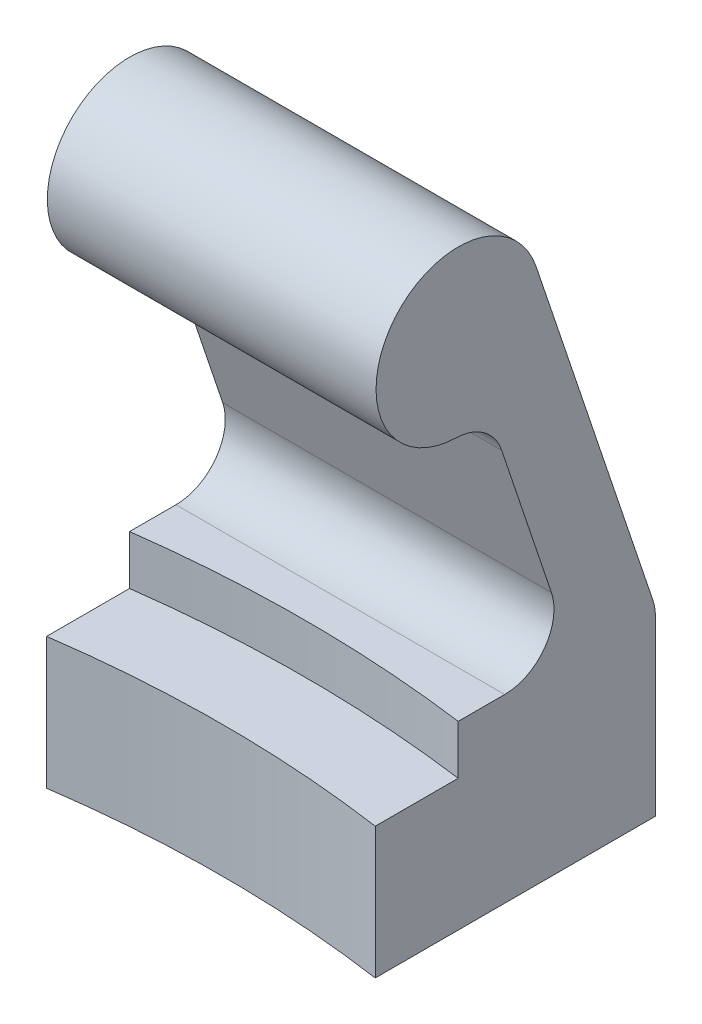
ISO-10303-21;
HEADER;
FILE_DESCRIPTION(('STEP AP214'),'2;1');
FILE_NAME('part.step','',(''),(''),'','','');
FILE_SCHEMA(('AUTOMOTIVE_DESIGN { 1 0 10303 214 1 1 1 1 }'));
ENDSEC;
DATA;
#1=APPLICATION_CONTEXT('core data for automotive mechanical design processes');
#2=APPLICATION_PROTOCOL_DEFINITION('international standard','automotive_design',2000,#1);
#3=PRODUCT_CONTEXT('',#1,'mechanical');
#4=PRODUCT('Part','Part','',(#3));
#5=PRODUCT_RELATED_PRODUCT_CATEGORY('part','',(#4));
#6=PRODUCT_DEFINITION_FORMATION('','',#4);
#7=PRODUCT_DEFINITION_CONTEXT('part definition',#1,'design');
#8=PRODUCT_DEFINITION('design','',#6,#7);
#9=PRODUCT_DEFINITION_SHAPE('','',#8);
#10=(LENGTH_UNIT() NAMED_UNIT(*) SI_UNIT(.MILLI.,.METRE.));
#11=(NAMED_UNIT(*) PLANE_ANGLE_UNIT() SI_UNIT($,.RADIAN.));
#12=(NAMED_UNIT(*) SI_UNIT($,.STERADIAN.) SOLID_ANGLE_UNIT());
#13=UNCERTAINTY_MEASURE_WITH_UNIT(LENGTH_MEASURE(1.E-05),#10,'distance_accuracy_value','');
#14=(GEOMETRIC_REPRESENTATION_CONTEXT(3) GLOBAL_UNCERTAINTY_ASSIGNED_CONTEXT((#13)) GLOBAL_UNIT_ASSIGNED_CONTEXT((#10,
#11,#12)) REPRESENTATION_CONTEXT('',''));
#15=CARTESIAN_POINT('',(0.,0.,0.));
#16=DIRECTION('',(0.,0.,1.));
#17=DIRECTION('',(1.,0.,0.));
#18=AXIS2_PLACEMENT_3D('',#15,#16,#17);
#19=CARTESIAN_POINT('',(0.,11.,0.));
#20=DIRECTION('',(0.,-1.,0.));
#21=DIRECTION('',(0.,0.,-1.));
#22=AXIS2_PLACEMENT_3D('',#19,#20,#21);
#23=PLANE('',#22);
#24=DIRECTION('',(0.,0.,-1.));
#25=VECTOR('',#24,1.);
#26=CARTESIAN_POINT('',(10.,11.,-86.3303437365925));
#27=LINE('',#26,#25);
#28=CARTESIAN_POINT('',(10.,11.,-74.3303437365925));
#29=VERTEX_POINT('',#28);
#30=CARTESIAN_POINT('',(10.,11.,-77.1565551566178));
#31=VERTEX_POINT('',#30);
#32=EDGE_CURVE('E169',#29,#31,#27,.T.);
#33=ORIENTED_EDGE('',*,*,#32,.T.);
#34=DIRECTION('',(1.,0.,0.));
#35=VECTOR('',#34,1.);
#36=CARTESIAN_POINT('',(0.,11.,-77.1565551566178));
#37=LINE('',#36,#35);
#38=CARTESIAN_POINT('',(-10.,11.,-77.1565551566178));
#39=VERTEX_POINT('',#38);
#40=EDGE_CURVE('E244',#31,#39,#37,.F.);
#41=ORIENTED_EDGE('',*,*,#40,.T.);
#42=DIRECTION('',(0.,0.,1.));
#43=VECTOR('',#42,1.);
#44=CARTESIAN_POINT('',(-10.,11.,-74.3303437365925));
#45=LINE('',#44,#43);
#46=CARTESIAN_POINT('',(-10.,11.,-74.3303437365925));
#47=VERTEX_POINT('',#46);
#48=EDGE_CURVE('E172',#39,#47,#45,.T.);
#49=ORIENTED_EDGE('',*,*,#48,.T.);
#50=CARTESIAN_POINT('',(0.,11.,0.));
#51=DIRECTION('',(0.,-1.,0.));
#52=DIRECTION('',(0.,0.,-1.));
#53=AXIS2_PLACEMENT_3D('',#50,#51,#52);
#54=CIRCLE('',#53,75.);
#55=EDGE_CURVE('E165',#47,#29,#54,.T.);
#56=ORIENTED_EDGE('',*,*,#55,.T.);
#57=EDGE_LOOP('',(#33,#41,#49,#56));
#58=FACE_BOUND('',#57,.T.);
#59=ADVANCED_FACE('F39',(#58),#23,.F.);
#60=CARTESIAN_POINT('',(0.,8.,0.));
#61=DIRECTION('',(0.,-1.,0.));
#62=DIRECTION('',(0.,0.,-1.));
#63=AXIS2_PLACEMENT_3D('',#60,#61,#62);
#64=PLANE('',#63);
#65=CARTESIAN_POINT('',(0.,8.,0.));
#66=DIRECTION('',(0.,-1.,0.));
#67=DIRECTION('',(0.,0.,-1.));
#68=AXIS2_PLACEMENT_3D('',#65,#66,#67);
#69=CIRCLE('',#68,75.);
#70=CARTESIAN_POINT('',(-10.,8.,-74.3303437365925));
#71=VERTEX_POINT('',#70);
#72=CARTESIAN_POINT('',(10.,8.,-74.3303437365925));
#73=VERTEX_POINT('',#72);
#74=EDGE_CURVE('E164',#71,#73,#69,.T.);
#75=ORIENTED_EDGE('',*,*,#74,.F.);
#76=DIRECTION('',(0.,0.,1.));
#77=VECTOR('',#76,1.);
#78=CARTESIAN_POINT('',(-10.,8.,-74.3303437365925));
#79=LINE('',#78,#77);
#80=CARTESIAN_POINT('',(-10.,8.,-69.2820323027551));
#81=VERTEX_POINT('',#80);
#82=EDGE_CURVE('E195',#71,#81,#79,.T.);
#83=ORIENTED_EDGE('',*,*,#82,.T.);
#84=CARTESIAN_POINT('',(0.,8.,0.));
#85=DIRECTION('',(0.,-1.,0.));
#86=DIRECTION('',(0.,0.,-1.));
#87=AXIS2_PLACEMENT_3D('',#84,#85,#86);
#88=CIRCLE('',#87,70.);
#89=CARTESIAN_POINT('',(10.,8.,-69.2820323027551));
#90=VERTEX_POINT('',#89);
#91=EDGE_CURVE('E187',#81,#90,#88,.T.);
#92=ORIENTED_EDGE('',*,*,#91,.T.);
#93=DIRECTION('',(0.,0.,-1.));
#94=VECTOR('',#93,1.);
#95=CARTESIAN_POINT('',(10.,8.,-69.2820323027551));
#96=LINE('',#95,#94);
#97=EDGE_CURVE('E191',#90,#73,#96,.T.);
#98=ORIENTED_EDGE('',*,*,#97,.T.);
#99=EDGE_LOOP('',(#75,#83,#92,#98));
#100=FACE_BOUND('',#99,.T.);
#101=ADVANCED_FACE('F280',(#100),#64,.F.);
#102=CARTESIAN_POINT('',(0.,8.,0.));
#103=DIRECTION('',(0.,-1.,0.));
#104=DIRECTION('',(0.,0.,-1.));
#105=AXIS2_PLACEMENT_3D('',#102,#103,#104);
#106=CYLINDRICAL_SURFACE('',#105,70.);
#107=CARTESIAN_POINT('',(0.,0.,0.));
#108=DIRECTION('',(0.,-1.,0.));
#109=DIRECTION('',(0.,0.,-1.));
#110=AXIS2_PLACEMENT_3D('',#107,#108,#109);
#111=CIRCLE('',#110,70.);
#112=CARTESIAN_POINT('',(-10.,0.,-69.2820323027551));
#113=VERTEX_POINT('',#112);
#114=CARTESIAN_POINT('',(10.,0.,-69.2820323027551));
#115=VERTEX_POINT('',#114);
#116=EDGE_CURVE('E186',#113,#115,#111,.T.);
#117=ORIENTED_EDGE('',*,*,#116,.T.);
#118=DIRECTION('',(0.,-1.,0.));
#119=VECTOR('',#118,1.);
#120=CARTESIAN_POINT('',(10.,8.,-69.2820323027551));
#121=LINE('',#120,#119);
#122=EDGE_CURVE('E221',#90,#115,#121,.T.);
#123=ORIENTED_EDGE('',*,*,#122,.F.);
#124=ORIENTED_EDGE('',*,*,#91,.F.);
#125=DIRECTION('',(0.,-1.,0.));
#126=VECTOR('',#125,1.);
#127=CARTESIAN_POINT('',(-10.,8.,-69.2820323027551));
#128=LINE('',#127,#126);
#129=EDGE_CURVE('E198',#81,#113,#128,.T.);
#130=ORIENTED_EDGE('',*,*,#129,.T.);
#131=EDGE_LOOP('',(#117,#123,#124,#130));
#132=FACE_BOUND('',#131,.T.);
#133=ADVANCED_FACE('F282',(#132),#106,.F.);
#134=CARTESIAN_POINT('',(10.,8.,-86.3303437365925));
#135=DIRECTION('',(-1.,0.,0.));
#136=DIRECTION('',(0.,0.,1.));
#137=AXIS2_PLACEMENT_3D('',#134,#135,#136);
#138=PLANE('',#137);
#139=DIRECTION('',(0.,-1.,0.));
#140=VECTOR('',#139,1.);
#141=CARTESIAN_POINT('',(10.,8.,-86.3303437365925));
#142=LINE('',#141,#140);
#143=CARTESIAN_POINT('',(10.,10.5091344412137,-86.3303437365925));
#144=VERTEX_POINT('',#143);
#145=CARTESIAN_POINT('',(10.,0.,-86.3303437365925));
#146=VERTEX_POINT('',#145);
#147=EDGE_CURVE('E218',#144,#146,#142,.T.);
#148=ORIENTED_EDGE('',*,*,#147,.F.);
#149=CARTESIAN_POINT('',(10.,10.5091344412137,-83.3303437365925));
#150=DIRECTION('',(-1.,0.,0.));
#151=DIRECTION('',(0.,0.,1.));
#152=AXIS2_PLACEMENT_3D('',#149,#150,#151);
#153=CIRCLE('',#152,3.);
#154=CARTESIAN_POINT('',(10.,11.465267849288,-86.1738994167163));
#155=VERTEX_POINT('',#154);
#156=EDGE_CURVE('E133',#144,#155,#153,.F.);
#157=ORIENTED_EDGE('',*,*,#156,.T.);
#158=DIRECTION('',(0.,0.947851893374597,0.318711136024758));
#159=VECTOR('',#158,1.);
#160=CARTESIAN_POINT('',(10.,11.,-86.3303437365925));
#161=LINE('',#160,#159);
#162=CARTESIAN_POINT('',(10.,32.5935556801238,-79.0696032034655));
#163=VERTEX_POINT('',#162);
#164=EDGE_CURVE('E126',#155,#163,#161,.T.);
#165=ORIENTED_EDGE('',*,*,#164,.T.);
#166=CARTESIAN_POINT('',(10.,31.,-74.3303437365925));
#167=DIRECTION('',(1.,0.,0.));
#168=DIRECTION('',(0.,0.,1.));
#169=AXIS2_PLACEMENT_3D('',#166,#167,#168);
#170=CIRCLE('',#169,5.);
#171=CARTESIAN_POINT('',(10.,26.0015760247574,-74.2048138050237));
#172=VERTEX_POINT('',#171);
#173=EDGE_CURVE('E131',#163,#172,#170,.T.);
#174=ORIENTED_EDGE('',*,*,#173,.T.);
#175=CARTESIAN_POINT('',(10.,23.0025216396118,-74.1294958460825));
#176=DIRECTION('',(-1.,0.,0.));
#177=DIRECTION('',(0.,0.,1.));
#178=AXIS2_PLACEMENT_3D('',#175,#176,#177);
#179=CIRCLE('',#178,3.);
#180=CARTESIAN_POINT('',(10.,23.9586550476861,-76.9730515262063));
#181=VERTEX_POINT('',#180);
#182=EDGE_CURVE('E247',#172,#181,#179,.T.);
#183=ORIENTED_EDGE('',*,*,#182,.T.);
#184=DIRECTION('',(0.,-0.947851893374597,-0.318711136024758));
#185=VECTOR('',#184,1.);
#186=CARTESIAN_POINT('',(10.,26.3502898620252,-76.1688745720192));
#187=LINE('',#186,#185);
#188=CARTESIAN_POINT('',(10.,14.9561334080743,-80.0001108367416));
#189=VERTEX_POINT('',#188);
#190=EDGE_CURVE('E149',#181,#189,#187,.T.);
#191=ORIENTED_EDGE('',*,*,#190,.T.);
#192=CARTESIAN_POINT('',(10.,14.,-77.1565551566178));
#193=DIRECTION('',(-1.,0.,0.));
#194=DIRECTION('',(0.,0.,1.));
#195=AXIS2_PLACEMENT_3D('',#192,#193,#194);
#196=CIRCLE('',#195,3.);
#197=EDGE_CURVE('E48',#189,#31,#196,.T.);
#198=ORIENTED_EDGE('',*,*,#197,.T.);
#199=ORIENTED_EDGE('',*,*,#32,.F.);
#200=DIRECTION('',(0.,-1.,0.));
#201=VECTOR('',#200,1.);
#202=CARTESIAN_POINT('',(10.,11.,-74.3303437365925));
#203=LINE('',#202,#201);
#204=EDGE_CURVE('E182',#29,#73,#203,.T.);
#205=ORIENTED_EDGE('',*,*,#204,.T.);
#206=ORIENTED_EDGE('',*,*,#97,.F.);
#207=ORIENTED_EDGE('',*,*,#122,.T.);
#208=DIRECTION('',(0.,0.,-1.));
#209=VECTOR('',#208,1.);
#210=CARTESIAN_POINT('',(10.,0.,-86.3303437365925));
#211=LINE('',#210,#209);
#212=EDGE_CURVE('E202',#115,#146,#211,.T.);
#213=ORIENTED_EDGE('',*,*,#212,.T.);
#214=EDGE_LOOP('',(#148,#157,#165,#174,#183,#191,#198,#199,#205,#206,#207,#213));
#215=FACE_BOUND('',#214,.T.);
#216=ADVANCED_FACE('F129',(#215),#138,.F.);
#217=CARTESIAN_POINT('',(-10.,8.,-86.3303437365925));
#218=DIRECTION('',(0.,0.,1.));
#219=DIRECTION('',(1.,0.,0.));
#220=AXIS2_PLACEMENT_3D('',#217,#218,#219);
#221=PLANE('',#220);
#222=DIRECTION('',(0.,-1.,0.));
#223=VECTOR('',#222,1.);
#224=CARTESIAN_POINT('',(-10.,8.,-86.3303437365925));
#225=LINE('',#224,#223);
#226=CARTESIAN_POINT('',(-10.,10.5091344412137,-86.3303437365925));
#227=VERTEX_POINT('',#226);
#228=CARTESIAN_POINT('',(-10.,0.,-86.3303437365925));
#229=VERTEX_POINT('',#228);
#230=EDGE_CURVE('E215',#227,#229,#225,.T.);
#231=ORIENTED_EDGE('',*,*,#230,.F.);
#232=DIRECTION('',(-1.,0.,0.));
#233=VECTOR('',#232,1.);
#234=CARTESIAN_POINT('',(10.,10.5091344412137,-86.3303437365925));
#235=LINE('',#234,#233);
#236=EDGE_CURVE('E231',#227,#144,#235,.F.);
#237=ORIENTED_EDGE('',*,*,#236,.T.);
#238=ORIENTED_EDGE('',*,*,#147,.T.);
#239=DIRECTION('',(-1.,0.,0.));
#240=VECTOR('',#239,1.);
#241=CARTESIAN_POINT('',(-10.,0.,-86.3303437365925));
#242=LINE('',#241,#240);
#243=EDGE_CURVE('E206',#146,#229,#242,.T.);
#244=ORIENTED_EDGE('',*,*,#243,.T.);
#245=EDGE_LOOP('',(#231,#237,#238,#244));
#246=FACE_BOUND('',#245,.T.);
#247=ADVANCED_FACE('F293',(#246),#221,.F.);
#248=CARTESIAN_POINT('',(-10.,8.,-69.2820323027551));
#249=DIRECTION('',(1.,0.,0.));
#250=DIRECTION('',(0.,0.,-1.));
#251=AXIS2_PLACEMENT_3D('',#248,#249,#250);
#252=PLANE('',#251);
#253=DIRECTION('',(0.,-0.947851893374597,-0.318711136024758));
#254=VECTOR('',#253,1.);
#255=CARTESIAN_POINT('',(-9.99999999999999,11.,-86.3303437365925));
#256=LINE('',#255,#254);
#257=CARTESIAN_POINT('',(-10.,32.5935556801238,-79.0696032034655));
#258=VERTEX_POINT('',#257);
#259=CARTESIAN_POINT('',(-9.99999999999999,11.465267849288,-86.1738994167163));
#260=VERTEX_POINT('',#259);
#261=EDGE_CURVE('E144',#258,#260,#256,.T.);
#262=ORIENTED_EDGE('',*,*,#261,.T.);
#263=CARTESIAN_POINT('',(-10.,10.5091344412137,-83.3303437365925));
#264=DIRECTION('',(1.,0.,0.));
#265=DIRECTION('',(0.,0.,-1.));
#266=AXIS2_PLACEMENT_3D('',#263,#264,#265);
#267=CIRCLE('',#266,3.);
#268=EDGE_CURVE('E228',#260,#227,#267,.F.);
#269=ORIENTED_EDGE('',*,*,#268,.T.);
#270=ORIENTED_EDGE('',*,*,#230,.T.);
#271=DIRECTION('',(0.,0.,1.));
#272=VECTOR('',#271,1.);
#273=CARTESIAN_POINT('',(-10.,0.,-69.2820323027551));
#274=LINE('',#273,#272);
#275=EDGE_CURVE('E192',#229,#113,#274,.T.);
#276=ORIENTED_EDGE('',*,*,#275,.T.);
#277=ORIENTED_EDGE('',*,*,#129,.F.);
#278=ORIENTED_EDGE('',*,*,#82,.F.);
#279=DIRECTION('',(0.,-1.,0.));
#280=VECTOR('',#279,1.);
#281=CARTESIAN_POINT('',(-10.,11.,-74.3303437365925));
#282=LINE('',#281,#280);
#283=EDGE_CURVE('E175',#47,#71,#282,.T.);
#284=ORIENTED_EDGE('',*,*,#283,.F.);
#285=ORIENTED_EDGE('',*,*,#48,.F.);
#286=CARTESIAN_POINT('',(-10.,14.,-77.1565551566178));
#287=DIRECTION('',(1.,0.,0.));
#288=DIRECTION('',(0.,0.,-1.));
#289=AXIS2_PLACEMENT_3D('',#286,#287,#288);
#290=CIRCLE('',#289,3.);
#291=CARTESIAN_POINT('',(-10.,14.9561334080743,-80.0001108367416));
#292=VERTEX_POINT('',#291);
#293=EDGE_CURVE('E11',#39,#292,#290,.T.);
#294=ORIENTED_EDGE('',*,*,#293,.T.);
#295=DIRECTION('',(0.,0.947851893374597,0.318711136024758));
#296=VECTOR('',#295,1.);
#297=CARTESIAN_POINT('',(-10.,26.3502898620253,-76.1688745720192));
#298=LINE('',#297,#296);
#299=CARTESIAN_POINT('',(-10.,23.9586550476861,-76.9730515262063));
#300=VERTEX_POINT('',#299);
#301=EDGE_CURVE('E148',#292,#300,#298,.T.);
#302=ORIENTED_EDGE('',*,*,#301,.T.);
#303=CARTESIAN_POINT('',(-10.,23.0025216396118,-74.1294958460825));
#304=DIRECTION('',(1.,0.,0.));
#305=DIRECTION('',(0.,0.,-1.));
#306=AXIS2_PLACEMENT_3D('',#303,#304,#305);
#307=CIRCLE('',#306,3.);
#308=CARTESIAN_POINT('',(-10.,26.0015760247574,-74.2048138050237));
#309=VERTEX_POINT('',#308);
#310=EDGE_CURVE('E250',#300,#309,#307,.T.);
#311=ORIENTED_EDGE('',*,*,#310,.T.);
#312=CARTESIAN_POINT('',(-10.,31.,-74.3303437365925));
#313=DIRECTION('',(1.,0.,0.));
#314=DIRECTION('',(0.,0.,-1.));
#315=AXIS2_PLACEMENT_3D('',#312,#313,#314);
#316=CIRCLE('',#315,5.);
#317=EDGE_CURVE('E161',#309,#258,#316,.F.);
#318=ORIENTED_EDGE('',*,*,#317,.T.);
#319=EDGE_LOOP('',(#262,#269,#270,#276,#277,#278,#284,#285,#294,#302,#311,#318));
#320=FACE_BOUND('',#319,.T.);
#321=ADVANCED_FACE('F260',(#320),#252,.F.);
#322=CARTESIAN_POINT('',(0.,0.,0.));
#323=DIRECTION('',(0.,-1.,0.));
#324=DIRECTION('',(0.,0.,-1.));
#325=AXIS2_PLACEMENT_3D('',#322,#323,#324);
#326=PLANE('',#325);
#327=ORIENTED_EDGE('',*,*,#116,.F.);
#328=ORIENTED_EDGE('',*,*,#275,.F.);
#329=ORIENTED_EDGE('',*,*,#243,.F.);
#330=ORIENTED_EDGE('',*,*,#212,.F.);
#331=EDGE_LOOP('',(#327,#328,#329,#330));
#332=FACE_BOUND('',#331,.T.);
#333=ADVANCED_FACE('F286',(#332),#326,.T.);
#334=CARTESIAN_POINT('',(0.,11.,0.));
#335=DIRECTION('',(0.,-1.,0.));
#336=DIRECTION('',(0.,0.,-1.));
#337=AXIS2_PLACEMENT_3D('',#334,#335,#336);
#338=CYLINDRICAL_SURFACE('',#337,75.);
#339=ORIENTED_EDGE('',*,*,#74,.T.);
#340=ORIENTED_EDGE('',*,*,#204,.F.);
#341=ORIENTED_EDGE('',*,*,#55,.F.);
#342=ORIENTED_EDGE('',*,*,#283,.T.);
#343=EDGE_LOOP('',(#339,#340,#341,#342));
#344=FACE_BOUND('',#343,.T.);
#345=ADVANCED_FACE('F276',(#344),#338,.F.);
#346=CARTESIAN_POINT('',(-40.2324329156619,11.,-86.3303437365925));
#347=DIRECTION('',(0.,0.318711136024758,-0.947851893374597));
#348=DIRECTION('',(0.,0.947851893374597,0.318711136024758));
#349=AXIS2_PLACEMENT_3D('',#346,#347,#348);
#350=PLANE('',#349);
#351=ORIENTED_EDGE('',*,*,#164,.F.);
#352=DIRECTION('',(-1.,0.,0.));
#353=VECTOR('',#352,1.);
#354=CARTESIAN_POINT('',(-10.,11.465267849288,-86.1738994167163));
#355=LINE('',#354,#353);
#356=EDGE_CURVE('E225',#155,#260,#355,.T.);
#357=ORIENTED_EDGE('',*,*,#356,.T.);
#358=ORIENTED_EDGE('',*,*,#261,.F.);
#359=DIRECTION('',(1.,0.,0.));
#360=VECTOR('',#359,1.);
#361=CARTESIAN_POINT('',(-40.2324329156619,32.5935556801238,-79.0696032034655));
#362=LINE('',#361,#360);
#363=EDGE_CURVE('E141',#258,#163,#362,.T.);
#364=ORIENTED_EDGE('',*,*,#363,.T.);
#365=EDGE_LOOP('',(#351,#357,#358,#364));
#366=FACE_BOUND('',#365,.T.);
#367=ADVANCED_FACE('F142',(#366),#350,.T.);
#368=CARTESIAN_POINT('',(-40.2324329156619,26.3502898620252,-76.1688745720192));
#369=DIRECTION('',(0.,-0.318711136024758,0.947851893374597));
#370=DIRECTION('',(0.,-0.947851893374597,-0.318711136024758));
#371=AXIS2_PLACEMENT_3D('',#368,#369,#370);
#372=PLANE('',#371);
#373=ORIENTED_EDGE('',*,*,#190,.F.);
#374=DIRECTION('',(-1.,0.,0.));
#375=VECTOR('',#374,1.);
#376=CARTESIAN_POINT('',(-10.,23.9586550476861,-76.9730515262063));
#377=LINE('',#376,#375);
#378=EDGE_CURVE('E241',#181,#300,#377,.T.);
#379=ORIENTED_EDGE('',*,*,#378,.T.);
#380=ORIENTED_EDGE('',*,*,#301,.F.);
#381=DIRECTION('',(1.,0.,0.));
#382=VECTOR('',#381,1.);
#383=CARTESIAN_POINT('',(-40.2324329156619,14.9561334080743,-80.0001108367416));
#384=LINE('',#383,#382);
#385=EDGE_CURVE('E238',#292,#189,#384,.T.);
#386=ORIENTED_EDGE('',*,*,#385,.T.);
#387=EDGE_LOOP('',(#373,#379,#380,#386));
#388=FACE_BOUND('',#387,.T.);
#389=ADVANCED_FACE('F268',(#388),#372,.T.);
#390=CARTESIAN_POINT('',(-40.2324329156619,31.,-74.3303437365925));
#391=DIRECTION('',(1.,0.,0.));
#392=DIRECTION('',(0.,0.,-1.));
#393=AXIS2_PLACEMENT_3D('',#390,#391,#392);
#394=CYLINDRICAL_SURFACE('',#393,5.);
#395=ORIENTED_EDGE('',*,*,#317,.F.);
#396=DIRECTION('',(1.,0.,0.));
#397=VECTOR('',#396,1.);
#398=CARTESIAN_POINT('',(-40.2324329156619,26.0015760247574,-74.2048138050237));
#399=LINE('',#398,#397);
#400=EDGE_CURVE('E154',#309,#172,#399,.T.);
#401=ORIENTED_EDGE('',*,*,#400,.T.);
#402=ORIENTED_EDGE('',*,*,#173,.F.);
#403=ORIENTED_EDGE('',*,*,#363,.F.);
#404=EDGE_LOOP('',(#395,#401,#402,#403));
#405=FACE_BOUND('',#404,.T.);
#406=ADVANCED_FACE('F152',(#405),#394,.T.);
#407=CARTESIAN_POINT('',(-40.2324329156619,10.5091344412137,-83.3303437365925));
#408=DIRECTION('',(1.,0.,0.));
#409=DIRECTION('',(0.,0.,-1.));
#410=AXIS2_PLACEMENT_3D('',#407,#408,#409);
#411=CYLINDRICAL_SURFACE('',#410,3.);
#412=ORIENTED_EDGE('',*,*,#156,.F.);
#413=ORIENTED_EDGE('',*,*,#236,.F.);
#414=ORIENTED_EDGE('',*,*,#268,.F.);
#415=ORIENTED_EDGE('',*,*,#356,.F.);
#416=EDGE_LOOP('',(#412,#413,#414,#415));
#417=FACE_BOUND('',#416,.T.);
#418=ADVANCED_FACE('F291',(#417),#411,.T.);
#419=CARTESIAN_POINT('',(-40.2324329156619,23.0025216396118,-74.1294958460825));
#420=DIRECTION('',(1.,0.,0.));
#421=DIRECTION('',(0.,0.,-1.));
#422=AXIS2_PLACEMENT_3D('',#419,#420,#421);
#423=CYLINDRICAL_SURFACE('',#422,3.);
#424=ORIENTED_EDGE('',*,*,#310,.F.);
#425=ORIENTED_EDGE('',*,*,#378,.F.);
#426=ORIENTED_EDGE('',*,*,#182,.F.);
#427=ORIENTED_EDGE('',*,*,#400,.F.);
#428=EDGE_LOOP('',(#424,#425,#426,#427));
#429=FACE_BOUND('',#428,.T.);
#430=ADVANCED_FACE('F266',(#429),#423,.F.);
#431=CARTESIAN_POINT('',(-40.2324329156619,14.,-77.1565551566178));
#432=DIRECTION('',(1.,0.,0.));
#433=DIRECTION('',(0.,0.,-1.));
#434=AXIS2_PLACEMENT_3D('',#431,#432,#433);
#435=CYLINDRICAL_SURFACE('',#434,3.);
#436=ORIENTED_EDGE('',*,*,#293,.F.);
#437=ORIENTED_EDGE('',*,*,#40,.F.);
#438=ORIENTED_EDGE('',*,*,#197,.F.);
#439=ORIENTED_EDGE('',*,*,#385,.F.);
#440=EDGE_LOOP('',(#436,#437,#438,#439));
#441=FACE_BOUND('',#440,.T.);
#442=ADVANCED_FACE('F41',(#441),#435,.F.);
#443=CLOSED_SHELL('',(#59,#101,#133,#216,#247,#321,#333,#345,#367,#389,#406,#418,#430,#442));
#444=MANIFOLD_SOLID_BREP('B2',#443);
#445=ADVANCED_BREP_SHAPE_REPRESENTATION('',(#18,#444),#14);
#446=SHAPE_DEFINITION_REPRESENTATION(#9,#445);
ENDSEC;
END-ISO-10303-21;
